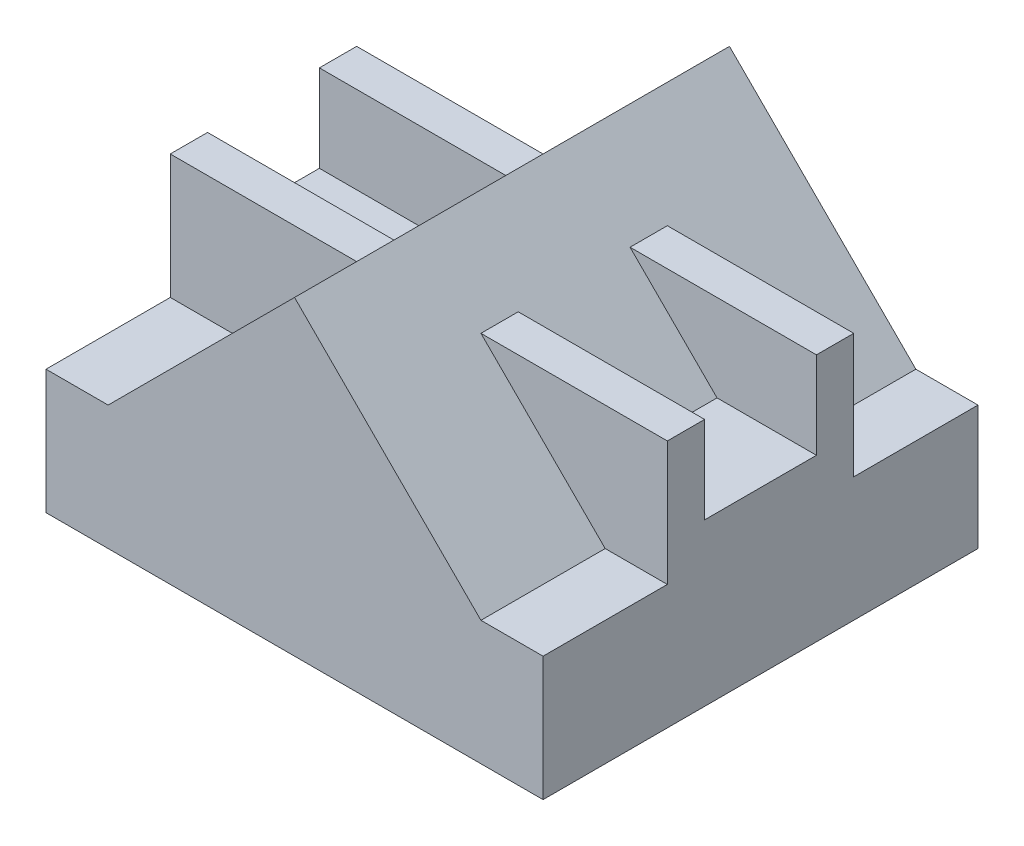
ISO-10303-21;
HEADER;
FILE_DESCRIPTION(('STEP AP214'),'2;1');
FILE_NAME('part.step','',(''),(''),'','','');
FILE_SCHEMA(('AUTOMOTIVE_DESIGN { 1 0 10303 214 1 1 1 1 }'));
ENDSEC;
DATA;
#1=APPLICATION_CONTEXT('core data for automotive mechanical design processes');
#2=APPLICATION_PROTOCOL_DEFINITION('international standard','automotive_design',2000,#1);
#3=PRODUCT_CONTEXT('',#1,'mechanical');
#4=PRODUCT('Part','Part','',(#3));
#5=PRODUCT_RELATED_PRODUCT_CATEGORY('part','',(#4));
#6=PRODUCT_DEFINITION_FORMATION('','',#4);
#7=PRODUCT_DEFINITION_CONTEXT('part definition',#1,'design');
#8=PRODUCT_DEFINITION('design','',#6,#7);
#9=PRODUCT_DEFINITION_SHAPE('','',#8);
#10=(LENGTH_UNIT() NAMED_UNIT(*) SI_UNIT(.MILLI.,.METRE.));
#11=(NAMED_UNIT(*) PLANE_ANGLE_UNIT() SI_UNIT($,.RADIAN.));
#12=(NAMED_UNIT(*) SI_UNIT($,.STERADIAN.) SOLID_ANGLE_UNIT());
#13=UNCERTAINTY_MEASURE_WITH_UNIT(LENGTH_MEASURE(1.E-05),#10,'distance_accuracy_value','');
#14=(GEOMETRIC_REPRESENTATION_CONTEXT(3) GLOBAL_UNCERTAINTY_ASSIGNED_CONTEXT((#13)) GLOBAL_UNIT_ASSIGNED_CONTEXT((#10,
#11,#12)) REPRESENTATION_CONTEXT('',''));
#15=CARTESIAN_POINT('',(0.,0.,0.));
#16=DIRECTION('',(0.,0.,1.));
#17=DIRECTION('',(1.,0.,0.));
#18=AXIS2_PLACEMENT_3D('',#15,#16,#17);
#19=CARTESIAN_POINT('',(0.,0.,0.));
#20=DIRECTION('',(0.,0.,1.));
#21=DIRECTION('',(1.,0.,0.));
#22=AXIS2_PLACEMENT_3D('',#19,#20,#21);
#23=PLANE('',#22);
#24=DIRECTION('',(0.707106781186547,-0.707106781186548,0.));
#25=VECTOR('',#24,1.);
#26=CARTESIAN_POINT('',(31.25,31.25,0.));
#27=LINE('',#26,#25);
#28=CARTESIAN_POINT('',(0.,62.5,0.));
#29=VERTEX_POINT('',#28);
#30=CARTESIAN_POINT('',(75.,-12.5,0.));
#31=VERTEX_POINT('',#30);
#32=EDGE_CURVE('E429',#29,#31,#27,.T.);
#33=ORIENTED_EDGE('',*,*,#32,.T.);
#34=DIRECTION('',(1.,0.,0.));
#35=VECTOR('',#34,1.);
#36=CARTESIAN_POINT('',(0.,-12.5,0.));
#37=LINE('',#36,#35);
#38=CARTESIAN_POINT('',(100.,-12.5,0.));
#39=VERTEX_POINT('',#38);
#40=EDGE_CURVE('E269',#31,#39,#37,.T.);
#41=ORIENTED_EDGE('',*,*,#40,.T.);
#42=DIRECTION('',(0.,1.,0.));
#43=VECTOR('',#42,1.);
#44=CARTESIAN_POINT('',(100.,0.,0.));
#45=LINE('',#44,#43);
#46=CARTESIAN_POINT('',(100.,-62.5,0.));
#47=VERTEX_POINT('',#46);
#48=EDGE_CURVE('E441',#47,#39,#45,.T.);
#49=ORIENTED_EDGE('',*,*,#48,.F.);
#50=DIRECTION('',(1.,0.,0.));
#51=VECTOR('',#50,1.);
#52=CARTESIAN_POINT('',(0.,-62.5,0.));
#53=LINE('',#52,#51);
#54=CARTESIAN_POINT('',(-100.,-62.5,0.));
#55=VERTEX_POINT('',#54);
#56=EDGE_CURVE('E447',#55,#47,#53,.T.);
#57=ORIENTED_EDGE('',*,*,#56,.F.);
#58=DIRECTION('',(0.,1.,0.));
#59=VECTOR('',#58,1.);
#60=CARTESIAN_POINT('',(-100.,0.,0.));
#61=LINE('',#60,#59);
#62=CARTESIAN_POINT('',(-100.,-12.5,0.));
#63=VERTEX_POINT('',#62);
#64=EDGE_CURVE('E458',#55,#63,#61,.T.);
#65=ORIENTED_EDGE('',*,*,#64,.T.);
#66=DIRECTION('',(1.,0.,0.));
#67=VECTOR('',#66,1.);
#68=CARTESIAN_POINT('',(0.,-12.5,0.));
#69=LINE('',#68,#67);
#70=CARTESIAN_POINT('',(-75.,-12.5,0.));
#71=VERTEX_POINT('',#70);
#72=EDGE_CURVE('E264',#63,#71,#69,.T.);
#73=ORIENTED_EDGE('',*,*,#72,.T.);
#74=DIRECTION('',(0.707106781186547,0.707106781186548,0.));
#75=VECTOR('',#74,1.);
#76=CARTESIAN_POINT('',(-31.25,31.25,0.));
#77=LINE('',#76,#75);
#78=EDGE_CURVE('E416',#71,#29,#77,.T.);
#79=ORIENTED_EDGE('',*,*,#78,.T.);
#80=EDGE_LOOP('',(#33,#41,#49,#57,#65,#73,#79));
#81=FACE_BOUND('',#80,.T.);
#82=ADVANCED_FACE('F67',(#81),#23,.F.);
#83=CARTESIAN_POINT('',(-100.,0.,175.));
#84=DIRECTION('',(-1.,0.,0.));
#85=DIRECTION('',(0.,0.,1.));
#86=AXIS2_PLACEMENT_3D('',#83,#84,#85);
#87=PLANE('',#86);
#88=DIRECTION('',(0.,1.,0.));
#89=VECTOR('',#88,1.);
#90=CARTESIAN_POINT('',(-100.,0.,110.));
#91=LINE('',#90,#89);
#92=CARTESIAN_POINT('',(-100.,2.50000000000001,110.));
#93=VERTEX_POINT('',#92);
#94=CARTESIAN_POINT('',(-100.,37.5,110.));
#95=VERTEX_POINT('',#94);
#96=EDGE_CURVE('E242',#93,#95,#91,.T.);
#97=ORIENTED_EDGE('',*,*,#96,.F.);
#98=DIRECTION('',(0.,0.,1.));
#99=VECTOR('',#98,1.);
#100=CARTESIAN_POINT('',(-100.,2.50000000000001,65.));
#101=LINE('',#100,#99);
#102=CARTESIAN_POINT('',(-100.,2.50000000000001,65.));
#103=VERTEX_POINT('',#102);
#104=EDGE_CURVE('E237',#103,#93,#101,.T.);
#105=ORIENTED_EDGE('',*,*,#104,.F.);
#106=DIRECTION('',(0.,1.,0.));
#107=VECTOR('',#106,1.);
#108=CARTESIAN_POINT('',(-100.,0.,65.));
#109=LINE('',#108,#107);
#110=CARTESIAN_POINT('',(-100.,37.5,65.));
#111=VERTEX_POINT('',#110);
#112=EDGE_CURVE('E220',#103,#111,#109,.T.);
#113=ORIENTED_EDGE('',*,*,#112,.T.);
#114=DIRECTION('',(0.,0.,-1.));
#115=VECTOR('',#114,1.);
#116=CARTESIAN_POINT('',(-100.,37.5,65.));
#117=LINE('',#116,#115);
#118=CARTESIAN_POINT('',(-100.,37.5,50.));
#119=VERTEX_POINT('',#118);
#120=EDGE_CURVE('E230',#111,#119,#117,.T.);
#121=ORIENTED_EDGE('',*,*,#120,.T.);
#122=DIRECTION('',(0.,1.,0.));
#123=VECTOR('',#122,1.);
#124=CARTESIAN_POINT('',(-100.,0.,50.));
#125=LINE('',#124,#123);
#126=CARTESIAN_POINT('',(-100.,-12.5,50.));
#127=VERTEX_POINT('',#126);
#128=EDGE_CURVE('E302',#127,#119,#125,.T.);
#129=ORIENTED_EDGE('',*,*,#128,.F.);
#130=DIRECTION('',(0.,0.,-1.));
#131=VECTOR('',#130,1.);
#132=CARTESIAN_POINT('',(-100.,-12.5,50.));
#133=LINE('',#132,#131);
#134=EDGE_CURVE('E305',#127,#63,#133,.T.);
#135=ORIENTED_EDGE('',*,*,#134,.T.);
#136=ORIENTED_EDGE('',*,*,#64,.F.);
#137=DIRECTION('',(0.,0.,-1.));
#138=VECTOR('',#137,1.);
#139=CARTESIAN_POINT('',(-100.,-62.5,175.));
#140=LINE('',#139,#138);
#141=CARTESIAN_POINT('',(-100.,-62.5,175.));
#142=VERTEX_POINT('',#141);
#143=EDGE_CURVE('E76',#142,#55,#140,.T.);
#144=ORIENTED_EDGE('',*,*,#143,.F.);
#145=DIRECTION('',(0.,1.,0.));
#146=VECTOR('',#145,1.);
#147=CARTESIAN_POINT('',(-100.,0.,175.));
#148=LINE('',#147,#146);
#149=CARTESIAN_POINT('',(-100.,-12.5,175.));
#150=VERTEX_POINT('',#149);
#151=EDGE_CURVE('E446',#142,#150,#148,.T.);
#152=ORIENTED_EDGE('',*,*,#151,.T.);
#153=DIRECTION('',(0.,0.,-1.));
#154=VECTOR('',#153,1.);
#155=CARTESIAN_POINT('',(-100.,-12.5,175.));
#156=LINE('',#155,#154);
#157=CARTESIAN_POINT('',(-100.,-12.5,125.));
#158=VERTEX_POINT('',#157);
#159=EDGE_CURVE('E407',#150,#158,#156,.T.);
#160=ORIENTED_EDGE('',*,*,#159,.T.);
#161=DIRECTION('',(0.,1.,0.));
#162=VECTOR('',#161,1.);
#163=CARTESIAN_POINT('',(-100.,0.,125.));
#164=LINE('',#163,#162);
#165=CARTESIAN_POINT('',(-100.,37.5,125.));
#166=VERTEX_POINT('',#165);
#167=EDGE_CURVE('E391',#158,#166,#164,.T.);
#168=ORIENTED_EDGE('',*,*,#167,.T.);
#169=DIRECTION('',(0.,0.,-1.));
#170=VECTOR('',#169,1.);
#171=CARTESIAN_POINT('',(-100.,37.5,125.));
#172=LINE('',#171,#170);
#173=EDGE_CURVE('E395',#166,#95,#172,.T.);
#174=ORIENTED_EDGE('',*,*,#173,.T.);
#175=EDGE_LOOP('',(#97,#105,#113,#121,#129,#135,#136,#144,#152,#160,#168,#174));
#176=FACE_BOUND('',#175,.T.);
#177=ADVANCED_FACE('F240',(#176),#87,.T.);
#178=CARTESIAN_POINT('',(100.,0.,175.));
#179=DIRECTION('',(-1.,0.,0.));
#180=DIRECTION('',(0.,0.,1.));
#181=AXIS2_PLACEMENT_3D('',#178,#179,#180);
#182=PLANE('',#181);
#183=DIRECTION('',(0.,0.,-1.));
#184=VECTOR('',#183,1.);
#185=CARTESIAN_POINT('',(100.,2.50000000000001,65.));
#186=LINE('',#185,#184);
#187=CARTESIAN_POINT('',(100.,2.50000000000001,110.));
#188=VERTEX_POINT('',#187);
#189=CARTESIAN_POINT('',(100.,2.50000000000001,65.));
#190=VERTEX_POINT('',#189);
#191=EDGE_CURVE('E250',#188,#190,#186,.T.);
#192=ORIENTED_EDGE('',*,*,#191,.F.);
#193=DIRECTION('',(0.,1.,0.));
#194=VECTOR('',#193,1.);
#195=CARTESIAN_POINT('',(100.,0.,110.));
#196=LINE('',#195,#194);
#197=CARTESIAN_POINT('',(100.,37.5,110.));
#198=VERTEX_POINT('',#197);
#199=EDGE_CURVE('E88',#188,#198,#196,.T.);
#200=ORIENTED_EDGE('',*,*,#199,.T.);
#201=DIRECTION('',(0.,0.,-1.));
#202=VECTOR('',#201,1.);
#203=CARTESIAN_POINT('',(100.,37.5,125.));
#204=LINE('',#203,#202);
#205=CARTESIAN_POINT('',(100.,37.5,125.));
#206=VERTEX_POINT('',#205);
#207=EDGE_CURVE('E373',#206,#198,#204,.T.);
#208=ORIENTED_EDGE('',*,*,#207,.F.);
#209=DIRECTION('',(0.,1.,0.));
#210=VECTOR('',#209,1.);
#211=CARTESIAN_POINT('',(100.,0.,125.));
#212=LINE('',#211,#210);
#213=CARTESIAN_POINT('',(100.,-12.5,125.));
#214=VERTEX_POINT('',#213);
#215=EDGE_CURVE('E370',#214,#206,#212,.T.);
#216=ORIENTED_EDGE('',*,*,#215,.F.);
#217=DIRECTION('',(0.,0.,-1.));
#218=VECTOR('',#217,1.);
#219=CARTESIAN_POINT('',(100.,-12.5,175.));
#220=LINE('',#219,#218);
#221=CARTESIAN_POINT('',(100.,-12.5,175.));
#222=VERTEX_POINT('',#221);
#223=EDGE_CURVE('E419',#222,#214,#220,.T.);
#224=ORIENTED_EDGE('',*,*,#223,.F.);
#225=DIRECTION('',(0.,1.,0.));
#226=VECTOR('',#225,1.);
#227=CARTESIAN_POINT('',(100.,0.,175.));
#228=LINE('',#227,#226);
#229=CARTESIAN_POINT('',(100.,-62.5,175.));
#230=VERTEX_POINT('',#229);
#231=EDGE_CURVE('E442',#230,#222,#228,.T.);
#232=ORIENTED_EDGE('',*,*,#231,.F.);
#233=DIRECTION('',(0.,0.,-1.));
#234=VECTOR('',#233,1.);
#235=CARTESIAN_POINT('',(100.,-62.5,175.));
#236=LINE('',#235,#234);
#237=EDGE_CURVE('E454',#230,#47,#236,.T.);
#238=ORIENTED_EDGE('',*,*,#237,.T.);
#239=ORIENTED_EDGE('',*,*,#48,.T.);
#240=DIRECTION('',(0.,0.,-1.));
#241=VECTOR('',#240,1.);
#242=CARTESIAN_POINT('',(100.,-12.5,50.));
#243=LINE('',#242,#241);
#244=CARTESIAN_POINT('',(100.,-12.5,50.));
#245=VERTEX_POINT('',#244);
#246=EDGE_CURVE('E279',#245,#39,#243,.T.);
#247=ORIENTED_EDGE('',*,*,#246,.F.);
#248=DIRECTION('',(0.,1.,0.));
#249=VECTOR('',#248,1.);
#250=CARTESIAN_POINT('',(100.,0.,50.));
#251=LINE('',#250,#249);
#252=CARTESIAN_POINT('',(100.,37.5,50.));
#253=VERTEX_POINT('',#252);
#254=EDGE_CURVE('E275',#245,#253,#251,.T.);
#255=ORIENTED_EDGE('',*,*,#254,.T.);
#256=DIRECTION('',(0.,0.,-1.));
#257=VECTOR('',#256,1.);
#258=CARTESIAN_POINT('',(100.,37.5,65.));
#259=LINE('',#258,#257);
#260=CARTESIAN_POINT('',(100.,37.5,65.));
#261=VERTEX_POINT('',#260);
#262=EDGE_CURVE('E335',#261,#253,#259,.T.);
#263=ORIENTED_EDGE('',*,*,#262,.F.);
#264=DIRECTION('',(0.,1.,0.));
#265=VECTOR('',#264,1.);
#266=CARTESIAN_POINT('',(100.,0.,65.));
#267=LINE('',#266,#265);
#268=EDGE_CURVE('E332',#190,#261,#267,.T.);
#269=ORIENTED_EDGE('',*,*,#268,.F.);
#270=EDGE_LOOP('',(#192,#200,#208,#216,#224,#232,#238,#239,#247,#255,#263,#269));
#271=FACE_BOUND('',#270,.T.);
#272=ADVANCED_FACE('F69',(#271),#182,.F.);
#273=CARTESIAN_POINT('',(0.,0.,175.));
#274=DIRECTION('',(0.,0.,1.));
#275=DIRECTION('',(1.,0.,0.));
#276=AXIS2_PLACEMENT_3D('',#273,#274,#275);
#277=PLANE('',#276);
#278=DIRECTION('',(0.707106781186547,0.707106781186548,0.));
#279=VECTOR('',#278,1.);
#280=CARTESIAN_POINT('',(-31.25,31.25,175.));
#281=LINE('',#280,#279);
#282=CARTESIAN_POINT('',(-75.,-12.5,175.));
#283=VERTEX_POINT('',#282);
#284=CARTESIAN_POINT('',(0.,62.5,175.));
#285=VERTEX_POINT('',#284);
#286=EDGE_CURVE('E426',#283,#285,#281,.T.);
#287=ORIENTED_EDGE('',*,*,#286,.F.);
#288=DIRECTION('',(1.,0.,0.));
#289=VECTOR('',#288,1.);
#290=CARTESIAN_POINT('',(0.,-12.5,175.));
#291=LINE('',#290,#289);
#292=EDGE_CURVE('E403',#150,#283,#291,.T.);
#293=ORIENTED_EDGE('',*,*,#292,.F.);
#294=ORIENTED_EDGE('',*,*,#151,.F.);
#295=DIRECTION('',(1.,0.,0.));
#296=VECTOR('',#295,1.);
#297=CARTESIAN_POINT('',(0.,-62.5,175.));
#298=LINE('',#297,#296);
#299=EDGE_CURVE('E451',#142,#230,#298,.T.);
#300=ORIENTED_EDGE('',*,*,#299,.T.);
#301=ORIENTED_EDGE('',*,*,#231,.T.);
#302=DIRECTION('',(1.,0.,0.));
#303=VECTOR('',#302,1.);
#304=CARTESIAN_POINT('',(0.,-12.5,175.));
#305=LINE('',#304,#303);
#306=CARTESIAN_POINT('',(75.,-12.5,175.));
#307=VERTEX_POINT('',#306);
#308=EDGE_CURVE('E402',#307,#222,#305,.T.);
#309=ORIENTED_EDGE('',*,*,#308,.F.);
#310=DIRECTION('',(0.707106781186547,-0.707106781186548,0.));
#311=VECTOR('',#310,1.);
#312=CARTESIAN_POINT('',(31.25,31.25,175.));
#313=LINE('',#312,#311);
#314=EDGE_CURVE('E432',#285,#307,#313,.T.);
#315=ORIENTED_EDGE('',*,*,#314,.F.);
#316=EDGE_LOOP('',(#287,#293,#294,#300,#301,#309,#315));
#317=FACE_BOUND('',#316,.T.);
#318=ADVANCED_FACE('F507',(#317),#277,.T.);
#319=CARTESIAN_POINT('',(0.,-62.5,175.));
#320=DIRECTION('',(0.,1.,0.));
#321=DIRECTION('',(0.,0.,1.));
#322=AXIS2_PLACEMENT_3D('',#319,#320,#321);
#323=PLANE('',#322);
#324=ORIENTED_EDGE('',*,*,#56,.T.);
#325=ORIENTED_EDGE('',*,*,#237,.F.);
#326=ORIENTED_EDGE('',*,*,#299,.F.);
#327=ORIENTED_EDGE('',*,*,#143,.T.);
#328=EDGE_LOOP('',(#324,#325,#326,#327));
#329=FACE_BOUND('',#328,.T.);
#330=ADVANCED_FACE('F470',(#329),#323,.F.);
#331=CARTESIAN_POINT('',(31.25,31.25,175.));
#332=DIRECTION('',(0.707106781186548,0.707106781186547,0.));
#333=DIRECTION('',(-0.707106781186547,0.707106781186548,0.));
#334=AXIS2_PLACEMENT_3D('',#331,#332,#333);
#335=PLANE('',#334);
#336=DIRECTION('',(0.,0.,1.));
#337=VECTOR('',#336,1.);
#338=CARTESIAN_POINT('',(60.,2.50000000000001,175.));
#339=LINE('',#338,#337);
#340=CARTESIAN_POINT('',(60.,2.50000000000001,65.));
#341=VERTEX_POINT('',#340);
#342=CARTESIAN_POINT('',(60.,2.50000000000001,110.));
#343=VERTEX_POINT('',#342);
#344=EDGE_CURVE('E260',#341,#343,#339,.T.);
#345=ORIENTED_EDGE('',*,*,#344,.F.);
#346=DIRECTION('',(0.707106781186547,-0.707106781186548,0.));
#347=VECTOR('',#346,1.);
#348=CARTESIAN_POINT('',(31.25,31.25,65.));
#349=LINE('',#348,#347);
#350=CARTESIAN_POINT('',(25.,37.5,65.));
#351=VERTEX_POINT('',#350);
#352=EDGE_CURVE('E329',#351,#341,#349,.T.);
#353=ORIENTED_EDGE('',*,*,#352,.F.);
#354=DIRECTION('',(0.,0.,-1.));
#355=VECTOR('',#354,1.);
#356=CARTESIAN_POINT('',(25.,37.5,65.));
#357=LINE('',#356,#355);
#358=CARTESIAN_POINT('',(25.,37.5,50.));
#359=VERTEX_POINT('',#358);
#360=EDGE_CURVE('E339',#351,#359,#357,.T.);
#361=ORIENTED_EDGE('',*,*,#360,.T.);
#362=DIRECTION('',(0.707106781186547,-0.707106781186548,0.));
#363=VECTOR('',#362,1.);
#364=CARTESIAN_POINT('',(31.25,31.25,50.));
#365=LINE('',#364,#363);
#366=CARTESIAN_POINT('',(75.,-12.5,50.));
#367=VERTEX_POINT('',#366);
#368=EDGE_CURVE('E268',#359,#367,#365,.T.);
#369=ORIENTED_EDGE('',*,*,#368,.T.);
#370=DIRECTION('',(0.,0.,-1.));
#371=VECTOR('',#370,1.);
#372=CARTESIAN_POINT('',(75.,-12.5,50.));
#373=LINE('',#372,#371);
#374=EDGE_CURVE('E286',#367,#31,#373,.T.);
#375=ORIENTED_EDGE('',*,*,#374,.T.);
#376=ORIENTED_EDGE('',*,*,#32,.F.);
#377=DIRECTION('',(0.,0.,-1.));
#378=VECTOR('',#377,1.);
#379=CARTESIAN_POINT('',(0.,62.5,175.));
#380=LINE('',#379,#378);
#381=EDGE_CURVE('E435',#285,#29,#380,.T.);
#382=ORIENTED_EDGE('',*,*,#381,.F.);
#383=ORIENTED_EDGE('',*,*,#314,.T.);
#384=DIRECTION('',(0.,0.,-1.));
#385=VECTOR('',#384,1.);
#386=CARTESIAN_POINT('',(75.,-12.5,175.));
#387=LINE('',#386,#385);
#388=CARTESIAN_POINT('',(75.,-12.5,125.));
#389=VERTEX_POINT('',#388);
#390=EDGE_CURVE('E408',#307,#389,#387,.T.);
#391=ORIENTED_EDGE('',*,*,#390,.T.);
#392=DIRECTION('',(0.707106781186547,-0.707106781186548,0.));
#393=VECTOR('',#392,1.);
#394=CARTESIAN_POINT('',(31.25,31.25,125.));
#395=LINE('',#394,#393);
#396=CARTESIAN_POINT('',(25.,37.5,125.));
#397=VERTEX_POINT('',#396);
#398=EDGE_CURVE('E364',#397,#389,#395,.T.);
#399=ORIENTED_EDGE('',*,*,#398,.F.);
#400=DIRECTION('',(0.,0.,-1.));
#401=VECTOR('',#400,1.);
#402=CARTESIAN_POINT('',(25.,37.5,125.));
#403=LINE('',#402,#401);
#404=CARTESIAN_POINT('',(25.,37.5,110.));
#405=VERTEX_POINT('',#404);
#406=EDGE_CURVE('E377',#397,#405,#403,.T.);
#407=ORIENTED_EDGE('',*,*,#406,.T.);
#408=DIRECTION('',(0.707106781186547,-0.707106781186548,0.));
#409=VECTOR('',#408,1.);
#410=CARTESIAN_POINT('',(31.25,31.25,110.));
#411=LINE('',#410,#409);
#412=EDGE_CURVE('E356',#405,#343,#411,.T.);
#413=ORIENTED_EDGE('',*,*,#412,.T.);
#414=EDGE_LOOP('',(#345,#353,#361,#369,#375,#376,#382,#383,#391,#399,#407,#413));
#415=FACE_BOUND('',#414,.T.);
#416=ADVANCED_FACE('F493',(#415),#335,.T.);
#417=CARTESIAN_POINT('',(-31.25,31.25,175.));
#418=DIRECTION('',(-0.707106781186548,0.707106781186547,0.));
#419=DIRECTION('',(-0.707106781186547,-0.707106781186548,0.));
#420=AXIS2_PLACEMENT_3D('',#417,#418,#419);
#421=PLANE('',#420);
#422=DIRECTION('',(0.,0.,-1.));
#423=VECTOR('',#422,1.);
#424=CARTESIAN_POINT('',(-60.,2.50000000000001,175.));
#425=LINE('',#424,#423);
#426=CARTESIAN_POINT('',(-60.,2.50000000000001,110.));
#427=VERTEX_POINT('',#426);
#428=CARTESIAN_POINT('',(-60.,2.50000000000001,65.));
#429=VERTEX_POINT('',#428);
#430=EDGE_CURVE('E238',#427,#429,#425,.T.);
#431=ORIENTED_EDGE('',*,*,#430,.F.);
#432=DIRECTION('',(0.707106781186547,0.707106781186548,0.));
#433=VECTOR('',#432,1.);
#434=CARTESIAN_POINT('',(-31.25,31.25,110.));
#435=LINE('',#434,#433);
#436=CARTESIAN_POINT('',(-25.,37.5,110.));
#437=VERTEX_POINT('',#436);
#438=EDGE_CURVE('E344',#427,#437,#435,.T.);
#439=ORIENTED_EDGE('',*,*,#438,.T.);
#440=DIRECTION('',(0.,0.,-1.));
#441=VECTOR('',#440,1.);
#442=CARTESIAN_POINT('',(-25.,37.5,125.));
#443=LINE('',#442,#441);
#444=CARTESIAN_POINT('',(-25.,37.5,125.));
#445=VERTEX_POINT('',#444);
#446=EDGE_CURVE('E398',#445,#437,#443,.T.);
#447=ORIENTED_EDGE('',*,*,#446,.F.);
#448=DIRECTION('',(0.707106781186547,0.707106781186548,0.));
#449=VECTOR('',#448,1.);
#450=CARTESIAN_POINT('',(-31.25,31.25,125.));
#451=LINE('',#450,#449);
#452=CARTESIAN_POINT('',(-75.,-12.5,125.));
#453=VERTEX_POINT('',#452);
#454=EDGE_CURVE('E384',#453,#445,#451,.T.);
#455=ORIENTED_EDGE('',*,*,#454,.F.);
#456=DIRECTION('',(0.,0.,-1.));
#457=VECTOR('',#456,1.);
#458=CARTESIAN_POINT('',(-75.,-12.5,175.));
#459=LINE('',#458,#457);
#460=EDGE_CURVE('E412',#283,#453,#459,.T.);
#461=ORIENTED_EDGE('',*,*,#460,.F.);
#462=ORIENTED_EDGE('',*,*,#286,.T.);
#463=ORIENTED_EDGE('',*,*,#381,.T.);
#464=ORIENTED_EDGE('',*,*,#78,.F.);
#465=DIRECTION('',(0.,0.,-1.));
#466=VECTOR('',#465,1.);
#467=CARTESIAN_POINT('',(-75.,-12.5,50.));
#468=LINE('',#467,#466);
#469=CARTESIAN_POINT('',(-75.,-12.5,50.));
#470=VERTEX_POINT('',#469);
#471=EDGE_CURVE('E283',#470,#71,#468,.T.);
#472=ORIENTED_EDGE('',*,*,#471,.F.);
#473=DIRECTION('',(0.707106781186547,0.707106781186548,0.));
#474=VECTOR('',#473,1.);
#475=CARTESIAN_POINT('',(-31.25,31.25,50.));
#476=LINE('',#475,#474);
#477=CARTESIAN_POINT('',(-25.,37.5,50.));
#478=VERTEX_POINT('',#477);
#479=EDGE_CURVE('E295',#470,#478,#476,.T.);
#480=ORIENTED_EDGE('',*,*,#479,.T.);
#481=DIRECTION('',(0.,0.,-1.));
#482=VECTOR('',#481,1.);
#483=CARTESIAN_POINT('',(-25.,37.5,65.));
#484=LINE('',#483,#482);
#485=CARTESIAN_POINT('',(-25.,37.5,65.));
#486=VERTEX_POINT('',#485);
#487=EDGE_CURVE('E321',#486,#478,#484,.T.);
#488=ORIENTED_EDGE('',*,*,#487,.F.);
#489=DIRECTION('',(0.707106781186547,0.707106781186548,0.));
#490=VECTOR('',#489,1.);
#491=CARTESIAN_POINT('',(-31.25,31.25,65.));
#492=LINE('',#491,#490);
#493=EDGE_CURVE('E290',#429,#486,#492,.T.);
#494=ORIENTED_EDGE('',*,*,#493,.F.);
#495=EDGE_LOOP('',(#431,#439,#447,#455,#461,#462,#463,#464,#472,#480,#488,#494));
#496=FACE_BOUND('',#495,.T.);
#497=ADVANCED_FACE('F486',(#496),#421,.T.);
#498=CARTESIAN_POINT('',(0.,-12.5,175.));
#499=DIRECTION('',(0.,1.,0.));
#500=DIRECTION('',(0.,0.,1.));
#501=AXIS2_PLACEMENT_3D('',#498,#499,#500);
#502=PLANE('',#501);
#503=DIRECTION('',(1.,0.,0.));
#504=VECTOR('',#503,1.);
#505=CARTESIAN_POINT('',(0.,-12.5,125.));
#506=LINE('',#505,#504);
#507=EDGE_CURVE('E381',#158,#453,#506,.T.);
#508=ORIENTED_EDGE('',*,*,#507,.F.);
#509=ORIENTED_EDGE('',*,*,#159,.F.);
#510=ORIENTED_EDGE('',*,*,#292,.T.);
#511=ORIENTED_EDGE('',*,*,#460,.T.);
#512=EDGE_LOOP('',(#508,#509,#510,#511));
#513=FACE_BOUND('',#512,.T.);
#514=ADVANCED_FACE('F511',(#513),#502,.T.);
#515=CARTESIAN_POINT('',(0.,-12.5,175.));
#516=DIRECTION('',(0.,1.,0.));
#517=DIRECTION('',(0.,0.,1.));
#518=AXIS2_PLACEMENT_3D('',#515,#516,#517);
#519=PLANE('',#518);
#520=DIRECTION('',(1.,0.,0.));
#521=VECTOR('',#520,1.);
#522=CARTESIAN_POINT('',(0.,-12.5,125.));
#523=LINE('',#522,#521);
#524=EDGE_CURVE('E367',#389,#214,#523,.T.);
#525=ORIENTED_EDGE('',*,*,#524,.F.);
#526=ORIENTED_EDGE('',*,*,#390,.F.);
#527=ORIENTED_EDGE('',*,*,#308,.T.);
#528=ORIENTED_EDGE('',*,*,#223,.T.);
#529=EDGE_LOOP('',(#525,#526,#527,#528));
#530=FACE_BOUND('',#529,.T.);
#531=ADVANCED_FACE('F653',(#530),#519,.T.);
#532=CARTESIAN_POINT('',(0.,37.5,125.));
#533=DIRECTION('',(0.,1.,0.));
#534=DIRECTION('',(0.,0.,1.));
#535=AXIS2_PLACEMENT_3D('',#532,#533,#534);
#536=PLANE('',#535);
#537=DIRECTION('',(1.,0.,0.));
#538=VECTOR('',#537,1.);
#539=CARTESIAN_POINT('',(0.,37.5,110.));
#540=LINE('',#539,#538);
#541=EDGE_CURVE('E347',#95,#437,#540,.T.);
#542=ORIENTED_EDGE('',*,*,#541,.F.);
#543=ORIENTED_EDGE('',*,*,#173,.F.);
#544=DIRECTION('',(1.,0.,0.));
#545=VECTOR('',#544,1.);
#546=CARTESIAN_POINT('',(0.,37.5,125.));
#547=LINE('',#546,#545);
#548=EDGE_CURVE('E387',#166,#445,#547,.T.);
#549=ORIENTED_EDGE('',*,*,#548,.T.);
#550=ORIENTED_EDGE('',*,*,#446,.T.);
#551=EDGE_LOOP('',(#542,#543,#549,#550));
#552=FACE_BOUND('',#551,.T.);
#553=ADVANCED_FACE('F520',(#552),#536,.T.);
#554=CARTESIAN_POINT('',(0.,0.,125.));
#555=DIRECTION('',(0.,0.,1.));
#556=DIRECTION('',(1.,0.,0.));
#557=AXIS2_PLACEMENT_3D('',#554,#555,#556);
#558=PLANE('',#557);
#559=ORIENTED_EDGE('',*,*,#507,.T.);
#560=ORIENTED_EDGE('',*,*,#454,.T.);
#561=ORIENTED_EDGE('',*,*,#548,.F.);
#562=ORIENTED_EDGE('',*,*,#167,.F.);
#563=EDGE_LOOP('',(#559,#560,#561,#562));
#564=FACE_BOUND('',#563,.T.);
#565=ADVANCED_FACE('F514',(#564),#558,.T.);
#566=CARTESIAN_POINT('',(0.,37.5,125.));
#567=DIRECTION('',(0.,1.,0.));
#568=DIRECTION('',(0.,0.,1.));
#569=AXIS2_PLACEMENT_3D('',#566,#567,#568);
#570=PLANE('',#569);
#571=DIRECTION('',(1.,0.,0.));
#572=VECTOR('',#571,1.);
#573=CARTESIAN_POINT('',(0.,37.5,110.));
#574=LINE('',#573,#572);
#575=EDGE_CURVE('E343',#405,#198,#574,.T.);
#576=ORIENTED_EDGE('',*,*,#575,.F.);
#577=ORIENTED_EDGE('',*,*,#406,.F.);
#578=DIRECTION('',(1.,0.,0.));
#579=VECTOR('',#578,1.);
#580=CARTESIAN_POINT('',(0.,37.5,125.));
#581=LINE('',#580,#579);
#582=EDGE_CURVE('E353',#397,#206,#581,.T.);
#583=ORIENTED_EDGE('',*,*,#582,.T.);
#584=ORIENTED_EDGE('',*,*,#207,.T.);
#585=EDGE_LOOP('',(#576,#577,#583,#584));
#586=FACE_BOUND('',#585,.T.);
#587=ADVANCED_FACE('F634',(#586),#570,.T.);
#588=CARTESIAN_POINT('',(0.,0.,125.));
#589=DIRECTION('',(0.,0.,1.));
#590=DIRECTION('',(1.,0.,0.));
#591=AXIS2_PLACEMENT_3D('',#588,#589,#590);
#592=PLANE('',#591);
#593=ORIENTED_EDGE('',*,*,#582,.F.);
#594=ORIENTED_EDGE('',*,*,#398,.T.);
#595=ORIENTED_EDGE('',*,*,#524,.T.);
#596=ORIENTED_EDGE('',*,*,#215,.T.);
#597=EDGE_LOOP('',(#593,#594,#595,#596));
#598=FACE_BOUND('',#597,.T.);
#599=ADVANCED_FACE('F534',(#598),#592,.T.);
#600=CARTESIAN_POINT('',(0.,0.,110.));
#601=DIRECTION('',(0.,0.,1.));
#602=DIRECTION('',(1.,0.,0.));
#603=AXIS2_PLACEMENT_3D('',#600,#601,#602);
#604=PLANE('',#603);
#605=ORIENTED_EDGE('',*,*,#199,.F.);
#606=DIRECTION('',(1.,0.,0.));
#607=VECTOR('',#606,1.);
#608=CARTESIAN_POINT('',(-100.,2.50000000000001,110.));
#609=LINE('',#608,#607);
#610=EDGE_CURVE('E83',#343,#188,#609,.T.);
#611=ORIENTED_EDGE('',*,*,#610,.F.);
#612=ORIENTED_EDGE('',*,*,#412,.F.);
#613=ORIENTED_EDGE('',*,*,#575,.T.);
#614=EDGE_LOOP('',(#605,#611,#612,#613));
#615=FACE_BOUND('',#614,.T.);
#616=ADVANCED_FACE('F525',(#615),#604,.F.);
#617=CARTESIAN_POINT('',(0.,0.,110.));
#618=DIRECTION('',(0.,0.,1.));
#619=DIRECTION('',(1.,0.,0.));
#620=AXIS2_PLACEMENT_3D('',#617,#618,#619);
#621=PLANE('',#620);
#622=ORIENTED_EDGE('',*,*,#438,.F.);
#623=EDGE_CURVE('E246',#93,#427,#609,.T.);
#624=ORIENTED_EDGE('',*,*,#623,.F.);
#625=ORIENTED_EDGE('',*,*,#96,.T.);
#626=ORIENTED_EDGE('',*,*,#541,.T.);
#627=EDGE_LOOP('',(#622,#624,#625,#626));
#628=FACE_BOUND('',#627,.T.);
#629=ADVANCED_FACE('F522',(#628),#621,.F.);
#630=CARTESIAN_POINT('',(0.,37.5,65.));
#631=DIRECTION('',(0.,1.,0.));
#632=DIRECTION('',(0.,0.,1.));
#633=AXIS2_PLACEMENT_3D('',#630,#631,#632);
#634=PLANE('',#633);
#635=DIRECTION('',(1.,0.,0.));
#636=VECTOR('',#635,1.);
#637=CARTESIAN_POINT('',(0.,37.5,50.));
#638=LINE('',#637,#636);
#639=EDGE_CURVE('E265',#359,#253,#638,.T.);
#640=ORIENTED_EDGE('',*,*,#639,.F.);
#641=ORIENTED_EDGE('',*,*,#360,.F.);
#642=DIRECTION('',(1.,0.,0.));
#643=VECTOR('',#642,1.);
#644=CARTESIAN_POINT('',(0.,37.5,65.));
#645=LINE('',#644,#643);
#646=EDGE_CURVE('E325',#351,#261,#645,.T.);
#647=ORIENTED_EDGE('',*,*,#646,.T.);
#648=ORIENTED_EDGE('',*,*,#262,.T.);
#649=EDGE_LOOP('',(#640,#641,#647,#648));
#650=FACE_BOUND('',#649,.T.);
#651=ADVANCED_FACE('F524',(#650),#634,.T.);
#652=CARTESIAN_POINT('',(0.,0.,65.));
#653=DIRECTION('',(0.,0.,1.));
#654=DIRECTION('',(1.,0.,0.));
#655=AXIS2_PLACEMENT_3D('',#652,#653,#654);
#656=PLANE('',#655);
#657=DIRECTION('',(-1.,0.,0.));
#658=VECTOR('',#657,1.);
#659=CARTESIAN_POINT('',(-100.,2.50000000000001,65.));
#660=LINE('',#659,#658);
#661=EDGE_CURVE('E254',#190,#341,#660,.T.);
#662=ORIENTED_EDGE('',*,*,#661,.F.);
#663=ORIENTED_EDGE('',*,*,#268,.T.);
#664=ORIENTED_EDGE('',*,*,#646,.F.);
#665=ORIENTED_EDGE('',*,*,#352,.T.);
#666=EDGE_LOOP('',(#662,#663,#664,#665));
#667=FACE_BOUND('',#666,.T.);
#668=ADVANCED_FACE('F531',(#667),#656,.T.);
#669=CARTESIAN_POINT('',(0.,37.5,65.));
#670=DIRECTION('',(0.,1.,0.));
#671=DIRECTION('',(0.,0.,1.));
#672=AXIS2_PLACEMENT_3D('',#669,#670,#671);
#673=PLANE('',#672);
#674=DIRECTION('',(1.,0.,0.));
#675=VECTOR('',#674,1.);
#676=CARTESIAN_POINT('',(0.,37.5,50.));
#677=LINE('',#676,#675);
#678=EDGE_CURVE('E298',#119,#478,#677,.T.);
#679=ORIENTED_EDGE('',*,*,#678,.F.);
#680=ORIENTED_EDGE('',*,*,#120,.F.);
#681=DIRECTION('',(1.,0.,0.));
#682=VECTOR('',#681,1.);
#683=CARTESIAN_POINT('',(0.,37.5,65.));
#684=LINE('',#683,#682);
#685=EDGE_CURVE('E224',#111,#486,#684,.T.);
#686=ORIENTED_EDGE('',*,*,#685,.T.);
#687=ORIENTED_EDGE('',*,*,#487,.T.);
#688=EDGE_LOOP('',(#679,#680,#686,#687));
#689=FACE_BOUND('',#688,.T.);
#690=ADVANCED_FACE('F606',(#689),#673,.T.);
#691=CARTESIAN_POINT('',(0.,0.,65.));
#692=DIRECTION('',(0.,0.,1.));
#693=DIRECTION('',(1.,0.,0.));
#694=AXIS2_PLACEMENT_3D('',#691,#692,#693);
#695=PLANE('',#694);
#696=DIRECTION('',(-1.,0.,0.));
#697=VECTOR('',#696,1.);
#698=CARTESIAN_POINT('',(0.,2.50000000000001,65.));
#699=LINE('',#698,#697);
#700=EDGE_CURVE('E12',#429,#103,#699,.T.);
#701=ORIENTED_EDGE('',*,*,#700,.F.);
#702=ORIENTED_EDGE('',*,*,#493,.T.);
#703=ORIENTED_EDGE('',*,*,#685,.F.);
#704=ORIENTED_EDGE('',*,*,#112,.F.);
#705=EDGE_LOOP('',(#701,#702,#703,#704));
#706=FACE_BOUND('',#705,.T.);
#707=ADVANCED_FACE('F221',(#706),#695,.T.);
#708=CARTESIAN_POINT('',(0.,-12.5,50.));
#709=DIRECTION('',(0.,1.,0.));
#710=DIRECTION('',(0.,0.,1.));
#711=AXIS2_PLACEMENT_3D('',#708,#709,#710);
#712=PLANE('',#711);
#713=ORIENTED_EDGE('',*,*,#72,.F.);
#714=ORIENTED_EDGE('',*,*,#134,.F.);
#715=DIRECTION('',(1.,0.,0.));
#716=VECTOR('',#715,1.);
#717=CARTESIAN_POINT('',(0.,-12.5,50.));
#718=LINE('',#717,#716);
#719=EDGE_CURVE('E291',#127,#470,#718,.T.);
#720=ORIENTED_EDGE('',*,*,#719,.T.);
#721=ORIENTED_EDGE('',*,*,#471,.T.);
#722=EDGE_LOOP('',(#713,#714,#720,#721));
#723=FACE_BOUND('',#722,.T.);
#724=ADVANCED_FACE('F479',(#723),#712,.T.);
#725=CARTESIAN_POINT('',(0.,0.,50.));
#726=DIRECTION('',(0.,0.,1.));
#727=DIRECTION('',(1.,0.,0.));
#728=AXIS2_PLACEMENT_3D('',#725,#726,#727);
#729=PLANE('',#728);
#730=ORIENTED_EDGE('',*,*,#719,.F.);
#731=ORIENTED_EDGE('',*,*,#128,.T.);
#732=ORIENTED_EDGE('',*,*,#678,.T.);
#733=ORIENTED_EDGE('',*,*,#479,.F.);
#734=EDGE_LOOP('',(#730,#731,#732,#733));
#735=FACE_BOUND('',#734,.T.);
#736=ADVANCED_FACE('F482',(#735),#729,.F.);
#737=CARTESIAN_POINT('',(0.,-12.5,50.));
#738=DIRECTION('',(0.,1.,0.));
#739=DIRECTION('',(0.,0.,1.));
#740=AXIS2_PLACEMENT_3D('',#737,#738,#739);
#741=PLANE('',#740);
#742=ORIENTED_EDGE('',*,*,#40,.F.);
#743=ORIENTED_EDGE('',*,*,#374,.F.);
#744=DIRECTION('',(1.,0.,0.));
#745=VECTOR('',#744,1.);
#746=CARTESIAN_POINT('',(0.,-12.5,50.));
#747=LINE('',#746,#745);
#748=EDGE_CURVE('E272',#367,#245,#747,.T.);
#749=ORIENTED_EDGE('',*,*,#748,.T.);
#750=ORIENTED_EDGE('',*,*,#246,.T.);
#751=EDGE_LOOP('',(#742,#743,#749,#750));
#752=FACE_BOUND('',#751,.T.);
#753=ADVANCED_FACE('F498',(#752),#741,.T.);
#754=CARTESIAN_POINT('',(0.,0.,50.));
#755=DIRECTION('',(0.,0.,1.));
#756=DIRECTION('',(1.,0.,0.));
#757=AXIS2_PLACEMENT_3D('',#754,#755,#756);
#758=PLANE('',#757);
#759=ORIENTED_EDGE('',*,*,#639,.T.);
#760=ORIENTED_EDGE('',*,*,#254,.F.);
#761=ORIENTED_EDGE('',*,*,#748,.F.);
#762=ORIENTED_EDGE('',*,*,#368,.F.);
#763=EDGE_LOOP('',(#759,#760,#761,#762));
#764=FACE_BOUND('',#763,.T.);
#765=ADVANCED_FACE('F566',(#764),#758,.F.);
#766=CARTESIAN_POINT('',(0.,2.50000000000001,0.));
#767=DIRECTION('',(0.,1.,0.));
#768=DIRECTION('',(0.,0.,1.));
#769=AXIS2_PLACEMENT_3D('',#766,#767,#768);
#770=PLANE('',#769);
#771=ORIENTED_EDGE('',*,*,#623,.T.);
#772=ORIENTED_EDGE('',*,*,#430,.T.);
#773=ORIENTED_EDGE('',*,*,#700,.T.);
#774=ORIENTED_EDGE('',*,*,#104,.T.);
#775=EDGE_LOOP('',(#771,#772,#773,#774));
#776=FACE_BOUND('',#775,.T.);
#777=ADVANCED_FACE('F236',(#776),#770,.T.);
#778=ORIENTED_EDGE('',*,*,#661,.T.);
#779=ORIENTED_EDGE('',*,*,#344,.T.);
#780=ORIENTED_EDGE('',*,*,#610,.T.);
#781=ORIENTED_EDGE('',*,*,#191,.T.);
#782=EDGE_LOOP('',(#778,#779,#780,#781));
#783=FACE_BOUND('',#782,.T.);
#784=ADVANCED_FACE('F796',(#783),#770,.T.);
#785=CLOSED_SHELL('',(#82,#177,#272,#318,#330,#416,#497,#514,#531,#553,#565,#587,#599,#616,#629,
#651,#668,#690,#707,#724,#736,#753,#765,#777,#784));
#786=MANIFOLD_SOLID_BREP('B2',#785);
#787=ADVANCED_BREP_SHAPE_REPRESENTATION('',(#18,#786),#14);
#788=SHAPE_DEFINITION_REPRESENTATION(#9,#787);
ENDSEC;
END-ISO-10303-21;
